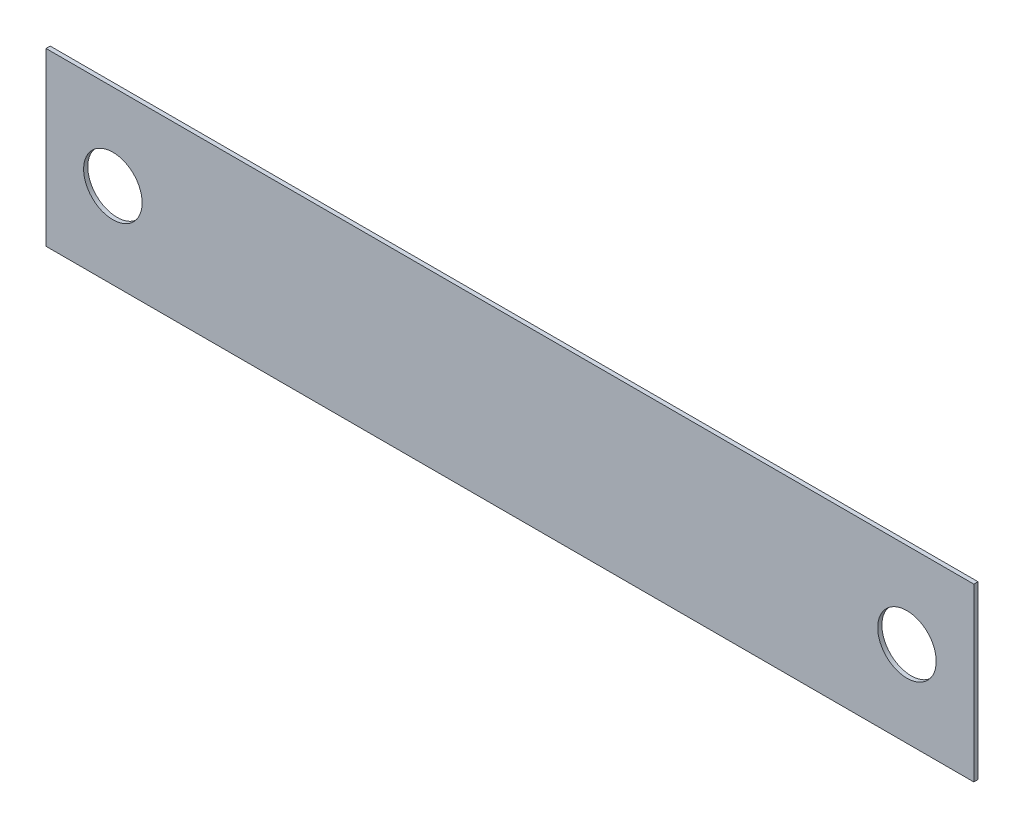
ISO-10303-21;
HEADER;
FILE_DESCRIPTION(('STEP AP214'),'2;1');
FILE_NAME('part.step','',(''),(''),'','','');
FILE_SCHEMA(('AUTOMOTIVE_DESIGN { 1 0 10303 214 1 1 1 1 }'));
ENDSEC;
DATA;
#1=APPLICATION_CONTEXT('core data for automotive mechanical design processes');
#2=APPLICATION_PROTOCOL_DEFINITION('international standard','automotive_design',2000,#1);
#3=PRODUCT_CONTEXT('',#1,'mechanical');
#4=PRODUCT('Part','Part','',(#3));
#5=PRODUCT_RELATED_PRODUCT_CATEGORY('part','',(#4));
#6=PRODUCT_DEFINITION_FORMATION('','',#4);
#7=PRODUCT_DEFINITION_CONTEXT('part definition',#1,'design');
#8=PRODUCT_DEFINITION('design','',#6,#7);
#9=PRODUCT_DEFINITION_SHAPE('','',#8);
#10=(LENGTH_UNIT() NAMED_UNIT(*) SI_UNIT(.MILLI.,.METRE.));
#11=(NAMED_UNIT(*) PLANE_ANGLE_UNIT() SI_UNIT($,.RADIAN.));
#12=(NAMED_UNIT(*) SI_UNIT($,.STERADIAN.) SOLID_ANGLE_UNIT());
#13=UNCERTAINTY_MEASURE_WITH_UNIT(LENGTH_MEASURE(1.E-05),#10,'distance_accuracy_value','');
#14=(GEOMETRIC_REPRESENTATION_CONTEXT(3) GLOBAL_UNCERTAINTY_ASSIGNED_CONTEXT((#13)) GLOBAL_UNIT_ASSIGNED_CONTEXT((#10,
#11,#12)) REPRESENTATION_CONTEXT('',''));
#15=CARTESIAN_POINT('',(0.,0.,0.));
#16=DIRECTION('',(0.,0.,1.));
#17=DIRECTION('',(1.,0.,0.));
#18=AXIS2_PLACEMENT_3D('',#15,#16,#17);
#19=CARTESIAN_POINT('',(0.,0.,0.5));
#20=DIRECTION('',(0.,0.,-1.));
#21=DIRECTION('',(-1.,0.,0.));
#22=AXIS2_PLACEMENT_3D('',#19,#20,#21);
#23=PLANE('',#22);
#24=CARTESIAN_POINT('',(8.,10.25,0.5));
#25=DIRECTION('',(0.,0.,1.));
#26=DIRECTION('',(1.,0.,0.));
#27=AXIS2_PLACEMENT_3D('',#24,#25,#26);
#28=CIRCLE('',#27,3.5);
#29=CARTESIAN_POINT('',(11.5,10.25,0.5));
#30=VERTEX_POINT('',#29);
#31=EDGE_CURVE('E101',#30,#30,#28,.T.);
#32=ORIENTED_EDGE('',*,*,#31,.F.);
#33=EDGE_LOOP('',(#32));
#34=FACE_BOUND('',#33,.T.);
#35=DIRECTION('',(0.,-1.,0.));
#36=VECTOR('',#35,1.);
#37=CARTESIAN_POINT('',(0.,0.,0.5));
#38=LINE('',#37,#36);
#39=CARTESIAN_POINT('',(0.,20.5,0.5));
#40=VERTEX_POINT('',#39);
#41=CARTESIAN_POINT('',(0.,0.,0.5));
#42=VERTEX_POINT('',#41);
#43=EDGE_CURVE('E86',#40,#42,#38,.T.);
#44=ORIENTED_EDGE('',*,*,#43,.T.);
#45=DIRECTION('',(1.,0.,0.));
#46=VECTOR('',#45,1.);
#47=CARTESIAN_POINT('',(0.,0.,0.5));
#48=LINE('',#47,#46);
#49=CARTESIAN_POINT('',(111.,0.,0.5));
#50=VERTEX_POINT('',#49);
#51=EDGE_CURVE('E81',#42,#50,#48,.T.);
#52=ORIENTED_EDGE('',*,*,#51,.T.);
#53=DIRECTION('',(0.,1.,0.));
#54=VECTOR('',#53,1.);
#55=CARTESIAN_POINT('',(111.,0.,0.5));
#56=LINE('',#55,#54);
#57=CARTESIAN_POINT('',(111.,20.5,0.5));
#58=VERTEX_POINT('',#57);
#59=EDGE_CURVE('E84',#50,#58,#56,.T.);
#60=ORIENTED_EDGE('',*,*,#59,.T.);
#61=DIRECTION('',(-1.,0.,0.));
#62=VECTOR('',#61,1.);
#63=CARTESIAN_POINT('',(0.,20.5,0.5));
#64=LINE('',#63,#62);
#65=EDGE_CURVE('E51',#58,#40,#64,.T.);
#66=ORIENTED_EDGE('',*,*,#65,.T.);
#67=EDGE_LOOP('',(#44,#52,#60,#66));
#68=FACE_BOUND('',#67,.T.);
#69=CARTESIAN_POINT('',(103.,10.25,0.5));
#70=DIRECTION('',(0.,0.,1.));
#71=DIRECTION('',(1.,0.,0.));
#72=AXIS2_PLACEMENT_3D('',#69,#70,#71);
#73=CIRCLE('',#72,3.50000000000001);
#74=CARTESIAN_POINT('',(106.5,10.25,0.5));
#75=VERTEX_POINT('',#74);
#76=EDGE_CURVE('E116',#75,#75,#73,.T.);
#77=ORIENTED_EDGE('',*,*,#76,.F.);
#78=EDGE_LOOP('',(#77));
#79=FACE_BOUND('',#78,.T.);
#80=ADVANCED_FACE('F34',(#34,#68,#79),#23,.F.);
#81=CARTESIAN_POINT('',(0.,0.,0.));
#82=DIRECTION('',(0.,0.,-1.));
#83=DIRECTION('',(-1.,0.,0.));
#84=AXIS2_PLACEMENT_3D('',#81,#82,#83);
#85=PLANE('',#84);
#86=CARTESIAN_POINT('',(8.,10.25,0.));
#87=DIRECTION('',(0.,0.,1.));
#88=DIRECTION('',(1.,0.,0.));
#89=AXIS2_PLACEMENT_3D('',#86,#87,#88);
#90=CIRCLE('',#89,3.5);
#91=CARTESIAN_POINT('',(11.5,10.25,0.));
#92=VERTEX_POINT('',#91);
#93=EDGE_CURVE('E113',#92,#92,#90,.T.);
#94=ORIENTED_EDGE('',*,*,#93,.T.);
#95=EDGE_LOOP('',(#94));
#96=FACE_BOUND('',#95,.T.);
#97=DIRECTION('',(0.,-1.,0.));
#98=VECTOR('',#97,1.);
#99=CARTESIAN_POINT('',(0.,0.,0.));
#100=LINE('',#99,#98);
#101=CARTESIAN_POINT('',(0.,20.5,0.));
#102=VERTEX_POINT('',#101);
#103=CARTESIAN_POINT('',(0.,0.,0.));
#104=VERTEX_POINT('',#103);
#105=EDGE_CURVE('E98',#102,#104,#100,.T.);
#106=ORIENTED_EDGE('',*,*,#105,.F.);
#107=DIRECTION('',(-1.,0.,0.));
#108=VECTOR('',#107,1.);
#109=CARTESIAN_POINT('',(0.,20.5,0.));
#110=LINE('',#109,#108);
#111=CARTESIAN_POINT('',(111.,20.5,0.));
#112=VERTEX_POINT('',#111);
#113=EDGE_CURVE('E74',#112,#102,#110,.T.);
#114=ORIENTED_EDGE('',*,*,#113,.F.);
#115=DIRECTION('',(0.,1.,0.));
#116=VECTOR('',#115,1.);
#117=CARTESIAN_POINT('',(111.,0.,0.));
#118=LINE('',#117,#116);
#119=CARTESIAN_POINT('',(111.,0.,0.));
#120=VERTEX_POINT('',#119);
#121=EDGE_CURVE('E68',#120,#112,#118,.T.);
#122=ORIENTED_EDGE('',*,*,#121,.F.);
#123=DIRECTION('',(1.,0.,0.));
#124=VECTOR('',#123,1.);
#125=CARTESIAN_POINT('',(0.,0.,0.));
#126=LINE('',#125,#124);
#127=EDGE_CURVE('E90',#104,#120,#126,.T.);
#128=ORIENTED_EDGE('',*,*,#127,.F.);
#129=EDGE_LOOP('',(#106,#114,#122,#128));
#130=FACE_BOUND('',#129,.T.);
#131=CARTESIAN_POINT('',(103.,10.25,0.));
#132=DIRECTION('',(0.,0.,1.));
#133=DIRECTION('',(1.,0.,0.));
#134=AXIS2_PLACEMENT_3D('',#131,#132,#133);
#135=CIRCLE('',#134,3.50000000000001);
#136=CARTESIAN_POINT('',(106.5,10.25,0.));
#137=VERTEX_POINT('',#136);
#138=EDGE_CURVE('E119',#137,#137,#135,.T.);
#139=ORIENTED_EDGE('',*,*,#138,.T.);
#140=EDGE_LOOP('',(#139));
#141=FACE_BOUND('',#140,.T.);
#142=ADVANCED_FACE('F109',(#96,#130,#141),#85,.T.);
#143=CARTESIAN_POINT('',(0.,0.,0.5));
#144=DIRECTION('',(1.,0.,0.));
#145=DIRECTION('',(0.,0.,-1.));
#146=AXIS2_PLACEMENT_3D('',#143,#144,#145);
#147=PLANE('',#146);
#148=ORIENTED_EDGE('',*,*,#105,.T.);
#149=DIRECTION('',(0.,0.,-1.));
#150=VECTOR('',#149,1.);
#151=CARTESIAN_POINT('',(0.,0.,0.5));
#152=LINE('',#151,#150);
#153=EDGE_CURVE('E11',#42,#104,#152,.T.);
#154=ORIENTED_EDGE('',*,*,#153,.F.);
#155=ORIENTED_EDGE('',*,*,#43,.F.);
#156=DIRECTION('',(0.,0.,-1.));
#157=VECTOR('',#156,1.);
#158=CARTESIAN_POINT('',(0.,20.5,0.5));
#159=LINE('',#158,#157);
#160=EDGE_CURVE('E94',#40,#102,#159,.T.);
#161=ORIENTED_EDGE('',*,*,#160,.T.);
#162=EDGE_LOOP('',(#148,#154,#155,#161));
#163=FACE_BOUND('',#162,.T.);
#164=ADVANCED_FACE('F36',(#163),#147,.F.);
#165=CARTESIAN_POINT('',(0.,0.,0.5));
#166=DIRECTION('',(0.,1.,0.));
#167=DIRECTION('',(0.,0.,1.));
#168=AXIS2_PLACEMENT_3D('',#165,#166,#167);
#169=PLANE('',#168);
#170=ORIENTED_EDGE('',*,*,#127,.T.);
#171=DIRECTION('',(0.,0.,-1.));
#172=VECTOR('',#171,1.);
#173=CARTESIAN_POINT('',(111.,0.,0.5));
#174=LINE('',#173,#172);
#175=EDGE_CURVE('E43',#50,#120,#174,.T.);
#176=ORIENTED_EDGE('',*,*,#175,.F.);
#177=ORIENTED_EDGE('',*,*,#51,.F.);
#178=ORIENTED_EDGE('',*,*,#153,.T.);
#179=EDGE_LOOP('',(#170,#176,#177,#178));
#180=FACE_BOUND('',#179,.T.);
#181=ADVANCED_FACE('F89',(#180),#169,.F.);
#182=CARTESIAN_POINT('',(111.,0.,0.5));
#183=DIRECTION('',(-1.,0.,0.));
#184=DIRECTION('',(0.,0.,1.));
#185=AXIS2_PLACEMENT_3D('',#182,#183,#184);
#186=PLANE('',#185);
#187=ORIENTED_EDGE('',*,*,#121,.T.);
#188=DIRECTION('',(0.,0.,-1.));
#189=VECTOR('',#188,1.);
#190=CARTESIAN_POINT('',(111.,20.5,0.5));
#191=LINE('',#190,#189);
#192=EDGE_CURVE('E91',#58,#112,#191,.T.);
#193=ORIENTED_EDGE('',*,*,#192,.F.);
#194=ORIENTED_EDGE('',*,*,#59,.F.);
#195=ORIENTED_EDGE('',*,*,#175,.T.);
#196=EDGE_LOOP('',(#187,#193,#194,#195));
#197=FACE_BOUND('',#196,.T.);
#198=ADVANCED_FACE('F92',(#197),#186,.F.);
#199=CARTESIAN_POINT('',(0.,20.5,0.5));
#200=DIRECTION('',(0.,-1.,0.));
#201=DIRECTION('',(0.,0.,-1.));
#202=AXIS2_PLACEMENT_3D('',#199,#200,#201);
#203=PLANE('',#202);
#204=ORIENTED_EDGE('',*,*,#113,.T.);
#205=ORIENTED_EDGE('',*,*,#160,.F.);
#206=ORIENTED_EDGE('',*,*,#65,.F.);
#207=ORIENTED_EDGE('',*,*,#192,.T.);
#208=EDGE_LOOP('',(#204,#205,#206,#207));
#209=FACE_BOUND('',#208,.T.);
#210=ADVANCED_FACE('F106',(#209),#203,.F.);
#211=CARTESIAN_POINT('',(8.,10.25,0.5));
#212=DIRECTION('',(0.,0.,-1.));
#213=DIRECTION('',(-1.,0.,0.));
#214=AXIS2_PLACEMENT_3D('',#211,#212,#213);
#215=CYLINDRICAL_SURFACE('',#214,3.5);
#216=ORIENTED_EDGE('',*,*,#31,.T.);
#217=EDGE_LOOP('',(#216));
#218=FACE_BOUND('',#217,.T.);
#219=ORIENTED_EDGE('',*,*,#93,.F.);
#220=EDGE_LOOP('',(#219));
#221=FACE_BOUND('',#220,.T.);
#222=ADVANCED_FACE('F137',(#218,#221),#215,.F.);
#223=CARTESIAN_POINT('',(103.,10.25,0.5));
#224=DIRECTION('',(0.,0.,-1.));
#225=DIRECTION('',(-1.,0.,0.));
#226=AXIS2_PLACEMENT_3D('',#223,#224,#225);
#227=CYLINDRICAL_SURFACE('',#226,3.50000000000001);
#228=ORIENTED_EDGE('',*,*,#76,.T.);
#229=EDGE_LOOP('',(#228));
#230=FACE_BOUND('',#229,.T.);
#231=ORIENTED_EDGE('',*,*,#138,.F.);
#232=EDGE_LOOP('',(#231));
#233=FACE_BOUND('',#232,.T.);
#234=ADVANCED_FACE('F125',(#230,#233),#227,.F.);
#235=CLOSED_SHELL('',(#80,#142,#164,#181,#198,#210,#222,#234));
#236=MANIFOLD_SOLID_BREP('B2',#235);
#237=ADVANCED_BREP_SHAPE_REPRESENTATION('',(#18,#236),#14);
#238=SHAPE_DEFINITION_REPRESENTATION(#9,#237);
ENDSEC;
END-ISO-10303-21;
